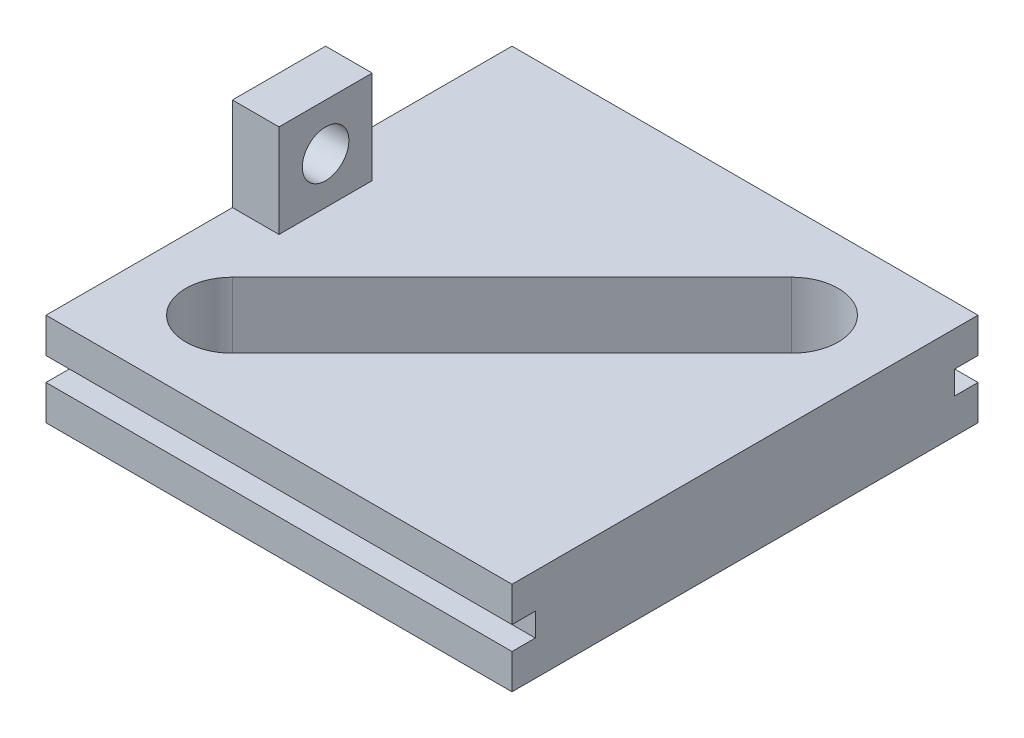
ISO-10303-21;
HEADER;
FILE_DESCRIPTION(('STEP AP214'),'2;1');
FILE_NAME('part.step','',(''),(''),'','','');
FILE_SCHEMA(('AUTOMOTIVE_DESIGN { 1 0 10303 214 1 1 1 1 }'));
ENDSEC;
DATA;
#1=APPLICATION_CONTEXT('core data for automotive mechanical design processes');
#2=APPLICATION_PROTOCOL_DEFINITION('international standard','automotive_design',2000,#1);
#3=PRODUCT_CONTEXT('',#1,'mechanical');
#4=PRODUCT('Part','Part','',(#3));
#5=PRODUCT_RELATED_PRODUCT_CATEGORY('part','',(#4));
#6=PRODUCT_DEFINITION_FORMATION('','',#4);
#7=PRODUCT_DEFINITION_CONTEXT('part definition',#1,'design');
#8=PRODUCT_DEFINITION('design','',#6,#7);
#9=PRODUCT_DEFINITION_SHAPE('','',#8);
#10=(LENGTH_UNIT() NAMED_UNIT(*) SI_UNIT(.MILLI.,.METRE.));
#11=(NAMED_UNIT(*) PLANE_ANGLE_UNIT() SI_UNIT($,.RADIAN.));
#12=(NAMED_UNIT(*) SI_UNIT($,.STERADIAN.) SOLID_ANGLE_UNIT());
#13=UNCERTAINTY_MEASURE_WITH_UNIT(LENGTH_MEASURE(1.E-05),#10,'distance_accuracy_value','');
#14=(GEOMETRIC_REPRESENTATION_CONTEXT(3) GLOBAL_UNCERTAINTY_ASSIGNED_CONTEXT((#13)) GLOBAL_UNIT_ASSIGNED_CONTEXT((#10,
#11,#12)) REPRESENTATION_CONTEXT('',''));
#15=CARTESIAN_POINT('',(0.,0.,0.));
#16=DIRECTION('',(0.,0.,1.));
#17=DIRECTION('',(1.,0.,0.));
#18=AXIS2_PLACEMENT_3D('',#15,#16,#17);
#19=CARTESIAN_POINT('',(0.,12.7,0.));
#20=DIRECTION('',(0.,-1.,0.));
#21=DIRECTION('',(0.,0.,-1.));
#22=AXIS2_PLACEMENT_3D('',#19,#20,#21);
#23=PLANE('',#22);
#24=CARTESIAN_POINT('',(-19.05,12.7,19.05));
#25=DIRECTION('',(0.,1.,0.));
#26=DIRECTION('',(0.,0.,1.));
#27=AXIS2_PLACEMENT_3D('',#24,#25,#26);
#28=CIRCLE('',#27,6.35000000000002);
#29=CARTESIAN_POINT('',(-23.5401280605346,12.7,14.5598719394654));
#30=VERTEX_POINT('',#29);
#31=CARTESIAN_POINT('',(-14.5598719394654,12.7,23.5401280605346));
#32=VERTEX_POINT('',#31);
#33=EDGE_CURVE('E248',#30,#32,#28,.T.);
#34=ORIENTED_EDGE('',*,*,#33,.F.);
#35=DIRECTION('',(-0.707106781186548,0.,0.707106781186548));
#36=VECTOR('',#35,1.);
#37=CARTESIAN_POINT('',(-23.5401280605346,12.7,14.5598719394654));
#38=LINE('',#37,#36);
#39=CARTESIAN_POINT('',(14.5598719394654,12.7,-23.5401280605346));
#40=VERTEX_POINT('',#39);
#41=EDGE_CURVE('E256',#40,#30,#38,.T.);
#42=ORIENTED_EDGE('',*,*,#41,.F.);
#43=CARTESIAN_POINT('',(19.05,12.7,-19.05));
#44=DIRECTION('',(0.,1.,0.));
#45=DIRECTION('',(0.,0.,-1.));
#46=AXIS2_PLACEMENT_3D('',#43,#44,#45);
#47=CIRCLE('',#46,6.35000000000002);
#48=CARTESIAN_POINT('',(23.5401280605346,12.7,-14.5598719394654));
#49=VERTEX_POINT('',#48);
#50=EDGE_CURVE('E253',#49,#40,#47,.T.);
#51=ORIENTED_EDGE('',*,*,#50,.F.);
#52=DIRECTION('',(0.707106781186548,0.,-0.707106781186548));
#53=VECTOR('',#52,1.);
#54=CARTESIAN_POINT('',(-14.5598719394654,12.7,23.5401280605346));
#55=LINE('',#54,#53);
#56=EDGE_CURVE('E250',#32,#49,#55,.T.);
#57=ORIENTED_EDGE('',*,*,#56,.F.);
#58=EDGE_LOOP('',(#34,#42,#51,#57));
#59=FACE_BOUND('',#58,.T.);
#60=DIRECTION('',(-1.,0.,0.));
#61=VECTOR('',#60,1.);
#62=CARTESIAN_POINT('',(-31.75,12.7,-6.35));
#63=LINE('',#62,#61);
#64=CARTESIAN_POINT('',(-25.4,12.7,-6.35));
#65=VERTEX_POINT('',#64);
#66=CARTESIAN_POINT('',(-31.75,12.7,-6.35));
#67=VERTEX_POINT('',#66);
#68=EDGE_CURVE('E49',#65,#67,#63,.T.);
#69=ORIENTED_EDGE('',*,*,#68,.F.);
#70=DIRECTION('',(0.,0.,-1.));
#71=VECTOR('',#70,1.);
#72=CARTESIAN_POINT('',(-25.4,12.7,-6.35));
#73=LINE('',#72,#71);
#74=CARTESIAN_POINT('',(-25.4,12.7,6.35));
#75=VERTEX_POINT('',#74);
#76=EDGE_CURVE('E370',#75,#65,#73,.T.);
#77=ORIENTED_EDGE('',*,*,#76,.F.);
#78=DIRECTION('',(1.,0.,0.));
#79=VECTOR('',#78,1.);
#80=CARTESIAN_POINT('',(-31.75,12.7,6.35));
#81=LINE('',#80,#79);
#82=CARTESIAN_POINT('',(-31.75,12.7,6.35));
#83=VERTEX_POINT('',#82);
#84=EDGE_CURVE('E55',#83,#75,#81,.T.);
#85=ORIENTED_EDGE('',*,*,#84,.F.);
#86=DIRECTION('',(0.,0.,1.));
#87=VECTOR('',#86,1.);
#88=CARTESIAN_POINT('',(-31.75,12.7,-31.75));
#89=LINE('',#88,#87);
#90=CARTESIAN_POINT('',(-31.75,12.7,31.75));
#91=VERTEX_POINT('',#90);
#92=EDGE_CURVE('E192',#83,#91,#89,.T.);
#93=ORIENTED_EDGE('',*,*,#92,.T.);
#94=DIRECTION('',(1.,0.,0.));
#95=VECTOR('',#94,1.);
#96=CARTESIAN_POINT('',(31.75,12.7,31.75));
#97=LINE('',#96,#95);
#98=CARTESIAN_POINT('',(31.75,12.7,31.75));
#99=VERTEX_POINT('',#98);
#100=EDGE_CURVE('E281',#91,#99,#97,.T.);
#101=ORIENTED_EDGE('',*,*,#100,.T.);
#102=DIRECTION('',(0.,0.,-1.));
#103=VECTOR('',#102,1.);
#104=CARTESIAN_POINT('',(31.75,12.7,-31.75));
#105=LINE('',#104,#103);
#106=CARTESIAN_POINT('',(31.75,12.7,-31.75));
#107=VERTEX_POINT('',#106);
#108=EDGE_CURVE('E283',#99,#107,#105,.T.);
#109=ORIENTED_EDGE('',*,*,#108,.T.);
#110=DIRECTION('',(-1.,0.,0.));
#111=VECTOR('',#110,1.);
#112=CARTESIAN_POINT('',(31.75,12.7,-31.75));
#113=LINE('',#112,#111);
#114=CARTESIAN_POINT('',(-31.75,12.7,-31.75));
#115=VERTEX_POINT('',#114);
#116=EDGE_CURVE('E285',#107,#115,#113,.T.);
#117=ORIENTED_EDGE('',*,*,#116,.T.);
#118=EDGE_CURVE('E279',#115,#67,#89,.T.);
#119=ORIENTED_EDGE('',*,*,#118,.T.);
#120=EDGE_LOOP('',(#69,#77,#85,#93,#101,#109,#117,#119));
#121=FACE_BOUND('',#120,.T.);
#122=ADVANCED_FACE('F33',(#59,#121),#23,.F.);
#123=CARTESIAN_POINT('',(-31.75,12.7,-31.75));
#124=DIRECTION('',(1.,0.,0.));
#125=DIRECTION('',(0.,0.,-1.));
#126=AXIS2_PLACEMENT_3D('',#123,#124,#125);
#127=PLANE('',#126);
#128=CARTESIAN_POINT('',(-31.75,19.05,0.));
#129=DIRECTION('',(-1.,0.,0.));
#130=DIRECTION('',(0.,0.,1.));
#131=AXIS2_PLACEMENT_3D('',#128,#129,#130);
#132=CIRCLE('',#131,3.175);
#133=CARTESIAN_POINT('',(-31.75,19.05,3.17500000000001));
#134=VERTEX_POINT('',#133);
#135=EDGE_CURVE('E374',#134,#134,#132,.T.);
#136=ORIENTED_EDGE('',*,*,#135,.F.);
#137=EDGE_LOOP('',(#136));
#138=FACE_BOUND('',#137,.T.);
#139=DIRECTION('',(0.,0.,-1.));
#140=VECTOR('',#139,1.);
#141=CARTESIAN_POINT('',(-31.75,4.7625,-28.575));
#142=LINE('',#141,#140);
#143=CARTESIAN_POINT('',(-31.75,4.7625,-28.575));
#144=VERTEX_POINT('',#143);
#145=CARTESIAN_POINT('',(-31.75,4.7625,-31.75));
#146=VERTEX_POINT('',#145);
#147=EDGE_CURVE('E215',#144,#146,#142,.T.);
#148=ORIENTED_EDGE('',*,*,#147,.T.);
#149=DIRECTION('',(0.,-1.,0.));
#150=VECTOR('',#149,1.);
#151=CARTESIAN_POINT('',(-31.75,12.7,-31.75));
#152=LINE('',#151,#150);
#153=CARTESIAN_POINT('',(-31.75,0.,-31.75));
#154=VERTEX_POINT('',#153);
#155=EDGE_CURVE('E287',#146,#154,#152,.T.);
#156=ORIENTED_EDGE('',*,*,#155,.T.);
#157=DIRECTION('',(0.,0.,1.));
#158=VECTOR('',#157,1.);
#159=CARTESIAN_POINT('',(-31.75,0.,-31.75));
#160=LINE('',#159,#158);
#161=CARTESIAN_POINT('',(-31.75,0.,31.75));
#162=VERTEX_POINT('',#161);
#163=EDGE_CURVE('E278',#154,#162,#160,.T.);
#164=ORIENTED_EDGE('',*,*,#163,.T.);
#165=DIRECTION('',(0.,-1.,0.));
#166=VECTOR('',#165,1.);
#167=CARTESIAN_POINT('',(-31.75,12.7,31.75));
#168=LINE('',#167,#166);
#169=CARTESIAN_POINT('',(-31.75,4.7625,31.75));
#170=VERTEX_POINT('',#169);
#171=EDGE_CURVE('E42',#170,#162,#168,.T.);
#172=ORIENTED_EDGE('',*,*,#171,.F.);
#173=DIRECTION('',(0.,0.,1.));
#174=VECTOR('',#173,1.);
#175=CARTESIAN_POINT('',(-31.75,4.7625,28.575));
#176=LINE('',#175,#174);
#177=CARTESIAN_POINT('',(-31.75,4.7625,28.575));
#178=VERTEX_POINT('',#177);
#179=EDGE_CURVE('E235',#178,#170,#176,.T.);
#180=ORIENTED_EDGE('',*,*,#179,.F.);
#181=DIRECTION('',(0.,-1.,0.));
#182=VECTOR('',#181,1.);
#183=CARTESIAN_POINT('',(-31.75,7.9375,28.575));
#184=LINE('',#183,#182);
#185=CARTESIAN_POINT('',(-31.75,7.9375,28.575));
#186=VERTEX_POINT('',#185);
#187=EDGE_CURVE('E224',#186,#178,#184,.T.);
#188=ORIENTED_EDGE('',*,*,#187,.F.);
#189=DIRECTION('',(0.,0.,1.));
#190=VECTOR('',#189,1.);
#191=CARTESIAN_POINT('',(-31.75,7.9375,28.575));
#192=LINE('',#191,#190);
#193=CARTESIAN_POINT('',(-31.75,7.9375,31.75));
#194=VERTEX_POINT('',#193);
#195=EDGE_CURVE('E238',#186,#194,#192,.T.);
#196=ORIENTED_EDGE('',*,*,#195,.T.);
#197=EDGE_CURVE('E11',#91,#194,#168,.T.);
#198=ORIENTED_EDGE('',*,*,#197,.F.);
#199=ORIENTED_EDGE('',*,*,#92,.F.);
#200=DIRECTION('',(0.,-1.,0.));
#201=VECTOR('',#200,1.);
#202=CARTESIAN_POINT('',(-31.75,25.4,6.35));
#203=LINE('',#202,#201);
#204=CARTESIAN_POINT('',(-31.75,25.4,6.35));
#205=VERTEX_POINT('',#204);
#206=EDGE_CURVE('E174',#205,#83,#203,.T.);
#207=ORIENTED_EDGE('',*,*,#206,.F.);
#208=DIRECTION('',(0.,0.,1.));
#209=VECTOR('',#208,1.);
#210=CARTESIAN_POINT('',(-31.75,25.4,-6.35));
#211=LINE('',#210,#209);
#212=CARTESIAN_POINT('',(-31.75,25.4,-6.35));
#213=VERTEX_POINT('',#212);
#214=EDGE_CURVE('E180',#213,#205,#211,.T.);
#215=ORIENTED_EDGE('',*,*,#214,.F.);
#216=DIRECTION('',(0.,-1.,0.));
#217=VECTOR('',#216,1.);
#218=CARTESIAN_POINT('',(-31.75,25.4,-6.35));
#219=LINE('',#218,#217);
#220=EDGE_CURVE('E363',#213,#67,#219,.T.);
#221=ORIENTED_EDGE('',*,*,#220,.T.);
#222=ORIENTED_EDGE('',*,*,#118,.F.);
#223=CARTESIAN_POINT('',(-31.75,7.9375,-31.75));
#224=VERTEX_POINT('',#223);
#225=EDGE_CURVE('E299',#115,#224,#152,.T.);
#226=ORIENTED_EDGE('',*,*,#225,.T.);
#227=DIRECTION('',(0.,0.,-1.));
#228=VECTOR('',#227,1.);
#229=CARTESIAN_POINT('',(-31.75,7.9375,-28.575));
#230=LINE('',#229,#228);
#231=CARTESIAN_POINT('',(-31.75,7.9375,-28.575));
#232=VERTEX_POINT('',#231);
#233=EDGE_CURVE('E211',#232,#224,#230,.T.);
#234=ORIENTED_EDGE('',*,*,#233,.F.);
#235=DIRECTION('',(0.,-1.,0.));
#236=VECTOR('',#235,1.);
#237=CARTESIAN_POINT('',(-31.75,7.9375,-28.575));
#238=LINE('',#237,#236);
#239=EDGE_CURVE('E202',#232,#144,#238,.T.);
#240=ORIENTED_EDGE('',*,*,#239,.T.);
#241=EDGE_LOOP('',(#148,#156,#164,#172,#180,#188,#196,#198,#199,#207,#215,#221,#222,#226,#234,#240));
#242=FACE_BOUND('',#241,.T.);
#243=ADVANCED_FACE('F35',(#138,#242),#127,.F.);
#244=CARTESIAN_POINT('',(31.75,12.7,-31.75));
#245=DIRECTION('',(-1.,0.,0.));
#246=DIRECTION('',(0.,0.,1.));
#247=AXIS2_PLACEMENT_3D('',#244,#245,#246);
#248=PLANE('',#247);
#249=DIRECTION('',(0.,0.,-1.));
#250=VECTOR('',#249,1.);
#251=CARTESIAN_POINT('',(31.75,4.7625,-28.575));
#252=LINE('',#251,#250);
#253=CARTESIAN_POINT('',(31.75,4.7625,-28.575));
#254=VERTEX_POINT('',#253);
#255=CARTESIAN_POINT('',(31.75,4.7625,-31.75));
#256=VERTEX_POINT('',#255);
#257=EDGE_CURVE('E218',#254,#256,#252,.T.);
#258=ORIENTED_EDGE('',*,*,#257,.F.);
#259=DIRECTION('',(0.,1.,0.));
#260=VECTOR('',#259,1.);
#261=CARTESIAN_POINT('',(31.75,7.9375,-28.575));
#262=LINE('',#261,#260);
#263=CARTESIAN_POINT('',(31.75,7.9375,-28.575));
#264=VERTEX_POINT('',#263);
#265=EDGE_CURVE('E207',#254,#264,#262,.T.);
#266=ORIENTED_EDGE('',*,*,#265,.T.);
#267=DIRECTION('',(0.,0.,-1.));
#268=VECTOR('',#267,1.);
#269=CARTESIAN_POINT('',(31.75,7.9375,-28.575));
#270=LINE('',#269,#268);
#271=CARTESIAN_POINT('',(31.75,7.9375,-31.75));
#272=VERTEX_POINT('',#271);
#273=EDGE_CURVE('E220',#264,#272,#270,.T.);
#274=ORIENTED_EDGE('',*,*,#273,.T.);
#275=DIRECTION('',(0.,-1.,0.));
#276=VECTOR('',#275,1.);
#277=CARTESIAN_POINT('',(31.75,12.7,-31.75));
#278=LINE('',#277,#276);
#279=EDGE_CURVE('E303',#107,#272,#278,.T.);
#280=ORIENTED_EDGE('',*,*,#279,.F.);
#281=ORIENTED_EDGE('',*,*,#108,.F.);
#282=DIRECTION('',(0.,-1.,0.));
#283=VECTOR('',#282,1.);
#284=CARTESIAN_POINT('',(31.75,12.7,31.75));
#285=LINE('',#284,#283);
#286=CARTESIAN_POINT('',(31.75,7.9375,31.75));
#287=VERTEX_POINT('',#286);
#288=EDGE_CURVE('E307',#99,#287,#285,.T.);
#289=ORIENTED_EDGE('',*,*,#288,.T.);
#290=DIRECTION('',(0.,0.,1.));
#291=VECTOR('',#290,1.);
#292=CARTESIAN_POINT('',(31.75,7.9375,28.575));
#293=LINE('',#292,#291);
#294=CARTESIAN_POINT('',(31.75,7.9375,28.575));
#295=VERTEX_POINT('',#294);
#296=EDGE_CURVE('E242',#295,#287,#293,.T.);
#297=ORIENTED_EDGE('',*,*,#296,.F.);
#298=DIRECTION('',(0.,1.,0.));
#299=VECTOR('',#298,1.);
#300=CARTESIAN_POINT('',(31.75,7.9375,28.575));
#301=LINE('',#300,#299);
#302=CARTESIAN_POINT('',(31.75,4.7625,28.575));
#303=VERTEX_POINT('',#302);
#304=EDGE_CURVE('E230',#303,#295,#301,.T.);
#305=ORIENTED_EDGE('',*,*,#304,.F.);
#306=DIRECTION('',(0.,0.,1.));
#307=VECTOR('',#306,1.);
#308=CARTESIAN_POINT('',(31.75,4.7625,28.575));
#309=LINE('',#308,#307);
#310=CARTESIAN_POINT('',(31.75,4.7625,31.75));
#311=VERTEX_POINT('',#310);
#312=EDGE_CURVE('E244',#303,#311,#309,.T.);
#313=ORIENTED_EDGE('',*,*,#312,.T.);
#314=CARTESIAN_POINT('',(31.75,0.,31.75));
#315=VERTEX_POINT('',#314);
#316=EDGE_CURVE('E306',#311,#315,#285,.T.);
#317=ORIENTED_EDGE('',*,*,#316,.T.);
#318=DIRECTION('',(0.,0.,-1.));
#319=VECTOR('',#318,1.);
#320=CARTESIAN_POINT('',(31.75,0.,-31.75));
#321=LINE('',#320,#319);
#322=CARTESIAN_POINT('',(31.75,0.,-31.75));
#323=VERTEX_POINT('',#322);
#324=EDGE_CURVE('E293',#315,#323,#321,.T.);
#325=ORIENTED_EDGE('',*,*,#324,.T.);
#326=EDGE_CURVE('E302',#256,#323,#278,.T.);
#327=ORIENTED_EDGE('',*,*,#326,.F.);
#328=EDGE_LOOP('',(#258,#266,#274,#280,#281,#289,#297,#305,#313,#317,#325,#327));
#329=FACE_BOUND('',#328,.T.);
#330=ADVANCED_FACE('F315',(#329),#248,.F.);
#331=CARTESIAN_POINT('',(31.75,12.7,-31.75));
#332=DIRECTION('',(0.,0.,1.));
#333=DIRECTION('',(1.,0.,0.));
#334=AXIS2_PLACEMENT_3D('',#331,#332,#333);
#335=PLANE('',#334);
#336=DIRECTION('',(1.,0.,0.));
#337=VECTOR('',#336,1.);
#338=CARTESIAN_POINT('',(-31.75,4.7625,-31.75));
#339=LINE('',#338,#337);
#340=EDGE_CURVE('E196',#146,#256,#339,.T.);
#341=ORIENTED_EDGE('',*,*,#340,.T.);
#342=ORIENTED_EDGE('',*,*,#326,.T.);
#343=DIRECTION('',(-1.,0.,0.));
#344=VECTOR('',#343,1.);
#345=CARTESIAN_POINT('',(31.75,0.,-31.75));
#346=LINE('',#345,#344);
#347=EDGE_CURVE('E296',#323,#154,#346,.T.);
#348=ORIENTED_EDGE('',*,*,#347,.T.);
#349=ORIENTED_EDGE('',*,*,#155,.F.);
#350=EDGE_LOOP('',(#341,#342,#348,#349));
#351=FACE_BOUND('',#350,.T.);
#352=ADVANCED_FACE('F332',(#351),#335,.F.);
#353=DIRECTION('',(-1.,0.,0.));
#354=VECTOR('',#353,1.);
#355=CARTESIAN_POINT('',(-31.75,7.9375,-31.75));
#356=LINE('',#355,#354);
#357=EDGE_CURVE('E193',#272,#224,#356,.T.);
#358=ORIENTED_EDGE('',*,*,#357,.T.);
#359=ORIENTED_EDGE('',*,*,#225,.F.);
#360=ORIENTED_EDGE('',*,*,#116,.F.);
#361=ORIENTED_EDGE('',*,*,#279,.T.);
#362=EDGE_LOOP('',(#358,#359,#360,#361));
#363=FACE_BOUND('',#362,.T.);
#364=ADVANCED_FACE('F347',(#363),#335,.F.);
#365=CARTESIAN_POINT('',(31.75,12.7,31.75));
#366=DIRECTION('',(0.,0.,-1.));
#367=DIRECTION('',(-1.,0.,0.));
#368=AXIS2_PLACEMENT_3D('',#365,#366,#367);
#369=PLANE('',#368);
#370=ORIENTED_EDGE('',*,*,#197,.T.);
#371=DIRECTION('',(-1.,0.,0.));
#372=VECTOR('',#371,1.);
#373=CARTESIAN_POINT('',(-31.75,7.9375,31.75));
#374=LINE('',#373,#372);
#375=EDGE_CURVE('E228',#287,#194,#374,.T.);
#376=ORIENTED_EDGE('',*,*,#375,.F.);
#377=ORIENTED_EDGE('',*,*,#288,.F.);
#378=ORIENTED_EDGE('',*,*,#100,.F.);
#379=EDGE_LOOP('',(#370,#376,#377,#378));
#380=FACE_BOUND('',#379,.T.);
#381=ADVANCED_FACE('F353',(#380),#369,.F.);
#382=CARTESIAN_POINT('',(0.,0.,0.));
#383=DIRECTION('',(0.,-1.,0.));
#384=DIRECTION('',(0.,0.,-1.));
#385=AXIS2_PLACEMENT_3D('',#382,#383,#384);
#386=PLANE('',#385);
#387=ORIENTED_EDGE('',*,*,#163,.F.);
#388=ORIENTED_EDGE('',*,*,#347,.F.);
#389=ORIENTED_EDGE('',*,*,#324,.F.);
#390=DIRECTION('',(1.,0.,0.));
#391=VECTOR('',#390,1.);
#392=CARTESIAN_POINT('',(31.75,0.,31.75));
#393=LINE('',#392,#391);
#394=EDGE_CURVE('E290',#162,#315,#393,.T.);
#395=ORIENTED_EDGE('',*,*,#394,.F.);
#396=EDGE_LOOP('',(#387,#388,#389,#395));
#397=FACE_BOUND('',#396,.T.);
#398=DIRECTION('',(-0.707106781186548,0.,0.707106781186548));
#399=VECTOR('',#398,1.);
#400=CARTESIAN_POINT('',(-23.5401280605346,0.,14.5598719394654));
#401=LINE('',#400,#399);
#402=CARTESIAN_POINT('',(14.5598719394654,0.,-23.5401280605346));
#403=VERTEX_POINT('',#402);
#404=CARTESIAN_POINT('',(-23.5401280605346,0.,14.5598719394654));
#405=VERTEX_POINT('',#404);
#406=EDGE_CURVE('E251',#403,#405,#401,.T.);
#407=ORIENTED_EDGE('',*,*,#406,.T.);
#408=CARTESIAN_POINT('',(-19.05,0.,19.05));
#409=DIRECTION('',(0.,1.,0.));
#410=DIRECTION('',(0.,0.,1.));
#411=AXIS2_PLACEMENT_3D('',#408,#409,#410);
#412=CIRCLE('',#411,6.35000000000002);
#413=CARTESIAN_POINT('',(-14.5598719394654,0.,23.5401280605346));
#414=VERTEX_POINT('',#413);
#415=EDGE_CURVE('E241',#405,#414,#412,.T.);
#416=ORIENTED_EDGE('',*,*,#415,.T.);
#417=DIRECTION('',(0.707106781186548,0.,-0.707106781186548));
#418=VECTOR('',#417,1.);
#419=CARTESIAN_POINT('',(-14.5598719394654,0.,23.5401280605346));
#420=LINE('',#419,#418);
#421=CARTESIAN_POINT('',(23.5401280605346,0.,-14.5598719394654));
#422=VERTEX_POINT('',#421);
#423=EDGE_CURVE('E261',#414,#422,#420,.T.);
#424=ORIENTED_EDGE('',*,*,#423,.T.);
#425=CARTESIAN_POINT('',(19.05,0.,-19.05));
#426=DIRECTION('',(0.,1.,0.));
#427=DIRECTION('',(0.,0.,-1.));
#428=AXIS2_PLACEMENT_3D('',#425,#426,#427);
#429=CIRCLE('',#428,6.35000000000002);
#430=EDGE_CURVE('E264',#422,#403,#429,.T.);
#431=ORIENTED_EDGE('',*,*,#430,.T.);
#432=EDGE_LOOP('',(#407,#416,#424,#431));
#433=FACE_BOUND('',#432,.T.);
#434=ADVANCED_FACE('F328',(#397,#433),#386,.T.);
#435=ORIENTED_EDGE('',*,*,#316,.F.);
#436=DIRECTION('',(1.,0.,0.));
#437=VECTOR('',#436,1.);
#438=CARTESIAN_POINT('',(-31.75,4.7625,31.75));
#439=LINE('',#438,#437);
#440=EDGE_CURVE('E217',#170,#311,#439,.T.);
#441=ORIENTED_EDGE('',*,*,#440,.F.);
#442=ORIENTED_EDGE('',*,*,#171,.T.);
#443=ORIENTED_EDGE('',*,*,#394,.T.);
#444=EDGE_LOOP('',(#435,#441,#442,#443));
#445=FACE_BOUND('',#444,.T.);
#446=ADVANCED_FACE('F324',(#445),#369,.F.);
#447=CARTESIAN_POINT('',(-19.05,12.7,19.05));
#448=DIRECTION('',(0.,-1.,0.));
#449=DIRECTION('',(0.,0.,-1.));
#450=AXIS2_PLACEMENT_3D('',#447,#448,#449);
#451=CYLINDRICAL_SURFACE('',#450,6.35000000000002);
#452=ORIENTED_EDGE('',*,*,#415,.F.);
#453=DIRECTION('',(0.,-1.,0.));
#454=VECTOR('',#453,1.);
#455=CARTESIAN_POINT('',(-23.5401280605346,12.7,14.5598719394654));
#456=LINE('',#455,#454);
#457=EDGE_CURVE('E258',#30,#405,#456,.T.);
#458=ORIENTED_EDGE('',*,*,#457,.F.);
#459=ORIENTED_EDGE('',*,*,#33,.T.);
#460=DIRECTION('',(0.,-1.,0.));
#461=VECTOR('',#460,1.);
#462=CARTESIAN_POINT('',(-14.5598719394654,12.7,23.5401280605346));
#463=LINE('',#462,#461);
#464=EDGE_CURVE('E275',#32,#414,#463,.T.);
#465=ORIENTED_EDGE('',*,*,#464,.T.);
#466=EDGE_LOOP('',(#452,#458,#459,#465));
#467=FACE_BOUND('',#466,.T.);
#468=ADVANCED_FACE('F402',(#467),#451,.F.);
#469=CARTESIAN_POINT('',(-14.5598719394654,12.7,23.5401280605346));
#470=DIRECTION('',(-0.707106781186548,0.,-0.707106781186547));
#471=DIRECTION('',(-0.707106781186547,0.,0.707106781186548));
#472=AXIS2_PLACEMENT_3D('',#469,#470,#471);
#473=PLANE('',#472);
#474=ORIENTED_EDGE('',*,*,#423,.F.);
#475=ORIENTED_EDGE('',*,*,#464,.F.);
#476=ORIENTED_EDGE('',*,*,#56,.T.);
#477=DIRECTION('',(0.,-1.,0.));
#478=VECTOR('',#477,1.);
#479=CARTESIAN_POINT('',(23.5401280605346,12.7,-14.5598719394654));
#480=LINE('',#479,#478);
#481=EDGE_CURVE('E273',#49,#422,#480,.T.);
#482=ORIENTED_EDGE('',*,*,#481,.T.);
#483=EDGE_LOOP('',(#474,#475,#476,#482));
#484=FACE_BOUND('',#483,.T.);
#485=ADVANCED_FACE('F413',(#484),#473,.T.);
#486=CARTESIAN_POINT('',(19.05,12.7,-19.05));
#487=DIRECTION('',(0.,-1.,0.));
#488=DIRECTION('',(0.,0.,-1.));
#489=AXIS2_PLACEMENT_3D('',#486,#487,#488);
#490=CYLINDRICAL_SURFACE('',#489,6.35000000000002);
#491=ORIENTED_EDGE('',*,*,#430,.F.);
#492=ORIENTED_EDGE('',*,*,#481,.F.);
#493=ORIENTED_EDGE('',*,*,#50,.T.);
#494=DIRECTION('',(0.,-1.,0.));
#495=VECTOR('',#494,1.);
#496=CARTESIAN_POINT('',(14.5598719394654,12.7,-23.5401280605346));
#497=LINE('',#496,#495);
#498=EDGE_CURVE('E271',#40,#403,#497,.T.);
#499=ORIENTED_EDGE('',*,*,#498,.T.);
#500=EDGE_LOOP('',(#491,#492,#493,#499));
#501=FACE_BOUND('',#500,.T.);
#502=ADVANCED_FACE('F522',(#501),#490,.F.);
#503=CARTESIAN_POINT('',(-23.5401280605346,12.7,14.5598719394654));
#504=DIRECTION('',(0.707106781186548,0.,0.707106781186547));
#505=DIRECTION('',(0.707106781186547,0.,-0.707106781186548));
#506=AXIS2_PLACEMENT_3D('',#503,#504,#505);
#507=PLANE('',#506);
#508=ORIENTED_EDGE('',*,*,#406,.F.);
#509=ORIENTED_EDGE('',*,*,#498,.F.);
#510=ORIENTED_EDGE('',*,*,#41,.T.);
#511=ORIENTED_EDGE('',*,*,#457,.T.);
#512=EDGE_LOOP('',(#508,#509,#510,#511));
#513=FACE_BOUND('',#512,.T.);
#514=ADVANCED_FACE('F515',(#513),#507,.T.);
#515=CARTESIAN_POINT('',(-31.75,7.9375,28.575));
#516=DIRECTION('',(0.,1.,0.));
#517=DIRECTION('',(0.,0.,1.));
#518=AXIS2_PLACEMENT_3D('',#515,#516,#517);
#519=PLANE('',#518);
#520=ORIENTED_EDGE('',*,*,#375,.T.);
#521=ORIENTED_EDGE('',*,*,#195,.F.);
#522=DIRECTION('',(-1.,0.,0.));
#523=VECTOR('',#522,1.);
#524=CARTESIAN_POINT('',(-31.75,7.9375,28.575));
#525=LINE('',#524,#523);
#526=EDGE_CURVE('E232',#295,#186,#525,.T.);
#527=ORIENTED_EDGE('',*,*,#526,.F.);
#528=ORIENTED_EDGE('',*,*,#296,.T.);
#529=EDGE_LOOP('',(#520,#521,#527,#528));
#530=FACE_BOUND('',#529,.T.);
#531=ADVANCED_FACE('F355',(#530),#519,.F.);
#532=CARTESIAN_POINT('',(-31.75,4.7625,28.575));
#533=DIRECTION('',(0.,-1.,0.));
#534=DIRECTION('',(0.,0.,-1.));
#535=AXIS2_PLACEMENT_3D('',#532,#533,#534);
#536=PLANE('',#535);
#537=ORIENTED_EDGE('',*,*,#440,.T.);
#538=ORIENTED_EDGE('',*,*,#312,.F.);
#539=DIRECTION('',(1.,0.,0.));
#540=VECTOR('',#539,1.);
#541=CARTESIAN_POINT('',(-31.75,4.7625,28.575));
#542=LINE('',#541,#540);
#543=EDGE_CURVE('E227',#178,#303,#542,.T.);
#544=ORIENTED_EDGE('',*,*,#543,.F.);
#545=ORIENTED_EDGE('',*,*,#179,.T.);
#546=EDGE_LOOP('',(#537,#538,#544,#545));
#547=FACE_BOUND('',#546,.T.);
#548=ADVANCED_FACE('F362',(#547),#536,.F.);
#549=CARTESIAN_POINT('',(0.,0.,28.575));
#550=DIRECTION('',(0.,0.,1.));
#551=DIRECTION('',(1.,0.,0.));
#552=AXIS2_PLACEMENT_3D('',#549,#550,#551);
#553=PLANE('',#552);
#554=ORIENTED_EDGE('',*,*,#187,.T.);
#555=ORIENTED_EDGE('',*,*,#543,.T.);
#556=ORIENTED_EDGE('',*,*,#304,.T.);
#557=ORIENTED_EDGE('',*,*,#526,.T.);
#558=EDGE_LOOP('',(#554,#555,#556,#557));
#559=FACE_BOUND('',#558,.T.);
#560=ADVANCED_FACE('F360',(#559),#553,.T.);
#561=CARTESIAN_POINT('',(-31.75,4.7625,-28.575));
#562=DIRECTION('',(0.,1.,0.));
#563=DIRECTION('',(0.,0.,1.));
#564=AXIS2_PLACEMENT_3D('',#561,#562,#563);
#565=PLANE('',#564);
#566=ORIENTED_EDGE('',*,*,#340,.F.);
#567=ORIENTED_EDGE('',*,*,#147,.F.);
#568=DIRECTION('',(1.,0.,0.));
#569=VECTOR('',#568,1.);
#570=CARTESIAN_POINT('',(-31.75,4.7625,-28.575));
#571=LINE('',#570,#569);
#572=EDGE_CURVE('E210',#144,#254,#571,.T.);
#573=ORIENTED_EDGE('',*,*,#572,.T.);
#574=ORIENTED_EDGE('',*,*,#257,.T.);
#575=EDGE_LOOP('',(#566,#567,#573,#574));
#576=FACE_BOUND('',#575,.T.);
#577=ADVANCED_FACE('F335',(#576),#565,.T.);
#578=CARTESIAN_POINT('',(-31.75,7.9375,-28.575));
#579=DIRECTION('',(0.,-1.,0.));
#580=DIRECTION('',(0.,0.,-1.));
#581=AXIS2_PLACEMENT_3D('',#578,#579,#580);
#582=PLANE('',#581);
#583=ORIENTED_EDGE('',*,*,#357,.F.);
#584=ORIENTED_EDGE('',*,*,#273,.F.);
#585=DIRECTION('',(-1.,0.,0.));
#586=VECTOR('',#585,1.);
#587=CARTESIAN_POINT('',(-31.75,7.9375,-28.575));
#588=LINE('',#587,#586);
#589=EDGE_CURVE('E205',#264,#232,#588,.T.);
#590=ORIENTED_EDGE('',*,*,#589,.T.);
#591=ORIENTED_EDGE('',*,*,#233,.T.);
#592=EDGE_LOOP('',(#583,#584,#590,#591));
#593=FACE_BOUND('',#592,.T.);
#594=ADVANCED_FACE('F343',(#593),#582,.T.);
#595=CARTESIAN_POINT('',(0.,0.,-28.575));
#596=DIRECTION('',(0.,0.,-1.));
#597=DIRECTION('',(1.,0.,0.));
#598=AXIS2_PLACEMENT_3D('',#595,#596,#597);
#599=PLANE('',#598);
#600=ORIENTED_EDGE('',*,*,#239,.F.);
#601=ORIENTED_EDGE('',*,*,#589,.F.);
#602=ORIENTED_EDGE('',*,*,#265,.F.);
#603=ORIENTED_EDGE('',*,*,#572,.F.);
#604=EDGE_LOOP('',(#600,#601,#602,#603));
#605=FACE_BOUND('',#604,.T.);
#606=ADVANCED_FACE('F340',(#605),#599,.T.);
#607=CARTESIAN_POINT('',(-31.75,25.4,6.35));
#608=DIRECTION('',(0.,0.,-1.));
#609=DIRECTION('',(-1.,0.,0.));
#610=AXIS2_PLACEMENT_3D('',#607,#608,#609);
#611=PLANE('',#610);
#612=ORIENTED_EDGE('',*,*,#84,.T.);
#613=DIRECTION('',(0.,-1.,0.));
#614=VECTOR('',#613,1.);
#615=CARTESIAN_POINT('',(-25.4,25.4,6.35));
#616=LINE('',#615,#614);
#617=CARTESIAN_POINT('',(-25.4,25.4,6.35));
#618=VERTEX_POINT('',#617);
#619=EDGE_CURVE('E176',#618,#75,#616,.T.);
#620=ORIENTED_EDGE('',*,*,#619,.F.);
#621=DIRECTION('',(1.,0.,0.));
#622=VECTOR('',#621,1.);
#623=CARTESIAN_POINT('',(-31.75,25.4,6.35));
#624=LINE('',#623,#622);
#625=EDGE_CURVE('E170',#205,#618,#624,.T.);
#626=ORIENTED_EDGE('',*,*,#625,.F.);
#627=ORIENTED_EDGE('',*,*,#206,.T.);
#628=EDGE_LOOP('',(#612,#620,#626,#627));
#629=FACE_BOUND('',#628,.T.);
#630=ADVANCED_FACE('F172',(#629),#611,.F.);
#631=CARTESIAN_POINT('',(-25.4,25.4,-6.35));
#632=DIRECTION('',(-1.,0.,0.));
#633=DIRECTION('',(0.,0.,1.));
#634=AXIS2_PLACEMENT_3D('',#631,#632,#633);
#635=PLANE('',#634);
#636=CARTESIAN_POINT('',(-25.4,19.05,0.));
#637=DIRECTION('',(-1.,0.,0.));
#638=DIRECTION('',(0.,0.,1.));
#639=AXIS2_PLACEMENT_3D('',#636,#637,#638);
#640=CIRCLE('',#639,3.175);
#641=CARTESIAN_POINT('',(-25.4,19.05,3.17500000000001));
#642=VERTEX_POINT('',#641);
#643=EDGE_CURVE('E37',#642,#642,#640,.T.);
#644=ORIENTED_EDGE('',*,*,#643,.T.);
#645=EDGE_LOOP('',(#644));
#646=FACE_BOUND('',#645,.T.);
#647=ORIENTED_EDGE('',*,*,#76,.T.);
#648=DIRECTION('',(0.,-1.,0.));
#649=VECTOR('',#648,1.);
#650=CARTESIAN_POINT('',(-25.4,25.4,-6.35));
#651=LINE('',#650,#649);
#652=CARTESIAN_POINT('',(-25.4,25.4,-6.35));
#653=VERTEX_POINT('',#652);
#654=EDGE_CURVE('E198',#653,#65,#651,.T.);
#655=ORIENTED_EDGE('',*,*,#654,.F.);
#656=DIRECTION('',(0.,0.,-1.));
#657=VECTOR('',#656,1.);
#658=CARTESIAN_POINT('',(-25.4,25.4,-6.35));
#659=LINE('',#658,#657);
#660=EDGE_CURVE('E179',#618,#653,#659,.T.);
#661=ORIENTED_EDGE('',*,*,#660,.F.);
#662=ORIENTED_EDGE('',*,*,#619,.T.);
#663=EDGE_LOOP('',(#647,#655,#661,#662));
#664=FACE_BOUND('',#663,.T.);
#665=ADVANCED_FACE('F381',(#646,#664),#635,.F.);
#666=CARTESIAN_POINT('',(-31.75,25.4,-6.35));
#667=DIRECTION('',(0.,0.,1.));
#668=DIRECTION('',(1.,0.,0.));
#669=AXIS2_PLACEMENT_3D('',#666,#667,#668);
#670=PLANE('',#669);
#671=ORIENTED_EDGE('',*,*,#68,.T.);
#672=ORIENTED_EDGE('',*,*,#220,.F.);
#673=DIRECTION('',(-1.,0.,0.));
#674=VECTOR('',#673,1.);
#675=CARTESIAN_POINT('',(-31.75,25.4,-6.35));
#676=LINE('',#675,#674);
#677=EDGE_CURVE('E185',#653,#213,#676,.T.);
#678=ORIENTED_EDGE('',*,*,#677,.F.);
#679=ORIENTED_EDGE('',*,*,#654,.T.);
#680=EDGE_LOOP('',(#671,#672,#678,#679));
#681=FACE_BOUND('',#680,.T.);
#682=ADVANCED_FACE('F390',(#681),#670,.F.);
#683=CARTESIAN_POINT('',(0.,25.4,0.));
#684=DIRECTION('',(0.,1.,0.));
#685=DIRECTION('',(0.,0.,1.));
#686=AXIS2_PLACEMENT_3D('',#683,#684,#685);
#687=PLANE('',#686);
#688=ORIENTED_EDGE('',*,*,#214,.T.);
#689=ORIENTED_EDGE('',*,*,#625,.T.);
#690=ORIENTED_EDGE('',*,*,#660,.T.);
#691=ORIENTED_EDGE('',*,*,#677,.T.);
#692=EDGE_LOOP('',(#688,#689,#690,#691));
#693=FACE_BOUND('',#692,.T.);
#694=ADVANCED_FACE('F183',(#693),#687,.T.);
#695=CARTESIAN_POINT('',(31.75,19.05,0.));
#696=DIRECTION('',(-1.,0.,0.));
#697=DIRECTION('',(0.,0.,1.));
#698=AXIS2_PLACEMENT_3D('',#695,#696,#697);
#699=CYLINDRICAL_SURFACE('',#698,3.175);
#700=ORIENTED_EDGE('',*,*,#135,.T.);
#701=EDGE_LOOP('',(#700));
#702=FACE_BOUND('',#701,.T.);
#703=ORIENTED_EDGE('',*,*,#643,.F.);
#704=EDGE_LOOP('',(#703));
#705=FACE_BOUND('',#704,.T.);
#706=ADVANCED_FACE('F384',(#702,#705),#699,.F.);
#707=CLOSED_SHELL('',(#122,#243,#330,#352,#364,#381,#434,#446,#468,#485,#502,#514,#531,#548,
#560,#577,#594,#606,#630,#665,#682,#694,#706));
#708=MANIFOLD_SOLID_BREP('B2',#707);
#709=ADVANCED_BREP_SHAPE_REPRESENTATION('',(#18,#708),#14);
#710=SHAPE_DEFINITION_REPRESENTATION(#9,#709);
ENDSEC;
END-ISO-10303-21;
